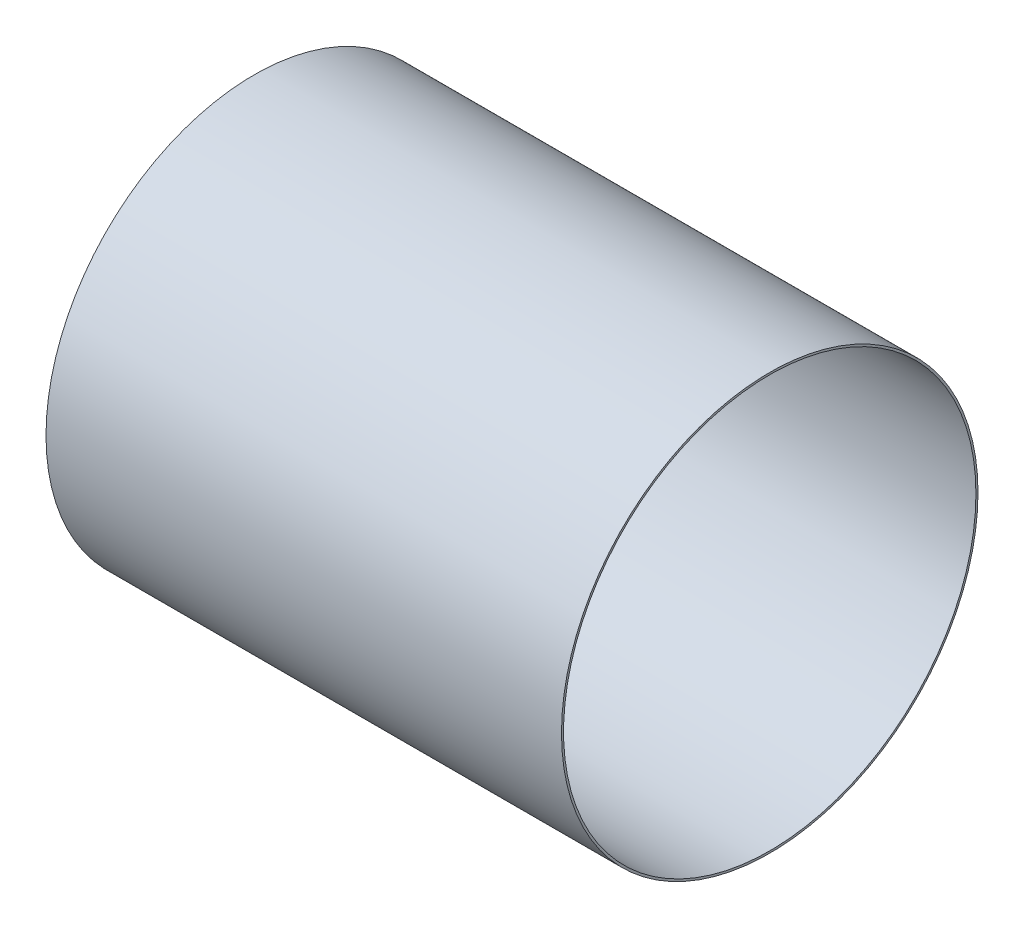
ISO-10303-21;
HEADER;
FILE_DESCRIPTION(('STEP AP214'),'2;1');
FILE_NAME('part.step','',(''),(''),'','','');
FILE_SCHEMA(('AUTOMOTIVE_DESIGN { 1 0 10303 214 1 1 1 1 }'));
ENDSEC;
DATA;
#1=APPLICATION_CONTEXT('core data for automotive mechanical design processes');
#2=APPLICATION_PROTOCOL_DEFINITION('international standard','automotive_design',2000,#1);
#3=PRODUCT_CONTEXT('',#1,'mechanical');
#4=PRODUCT('Part','Part','',(#3));
#5=PRODUCT_RELATED_PRODUCT_CATEGORY('part','',(#4));
#6=PRODUCT_DEFINITION_FORMATION('','',#4);
#7=PRODUCT_DEFINITION_CONTEXT('part definition',#1,'design');
#8=PRODUCT_DEFINITION('design','',#6,#7);
#9=PRODUCT_DEFINITION_SHAPE('','',#8);
#10=(LENGTH_UNIT() NAMED_UNIT(*) SI_UNIT(.MILLI.,.METRE.));
#11=(NAMED_UNIT(*) PLANE_ANGLE_UNIT() SI_UNIT($,.RADIAN.));
#12=(NAMED_UNIT(*) SI_UNIT($,.STERADIAN.) SOLID_ANGLE_UNIT());
#13=UNCERTAINTY_MEASURE_WITH_UNIT(LENGTH_MEASURE(1.E-05),#10,'distance_accuracy_value','');
#14=(GEOMETRIC_REPRESENTATION_CONTEXT(3) GLOBAL_UNCERTAINTY_ASSIGNED_CONTEXT((#13)) GLOBAL_UNIT_ASSIGNED_CONTEXT((#10,
#11,#12)) REPRESENTATION_CONTEXT('',''));
#15=CARTESIAN_POINT('',(0.,0.,0.));
#16=DIRECTION('',(0.,0.,1.));
#17=DIRECTION('',(1.,0.,0.));
#18=AXIS2_PLACEMENT_3D('',#15,#16,#17);
#19=CARTESIAN_POINT('',(0.,0.,0.));
#20=DIRECTION('',(-1.,0.,0.));
#21=DIRECTION('',(0.,0.,1.));
#22=AXIS2_PLACEMENT_3D('',#19,#20,#21);
#23=PLANE('',#22);
#24=CARTESIAN_POINT('',(0.,101.,0.));
#25=DIRECTION('',(1.,0.,0.));
#26=DIRECTION('',(0.,0.,-1.));
#27=AXIS2_PLACEMENT_3D('',#24,#25,#26);
#28=CIRCLE('',#27,100.);
#29=CARTESIAN_POINT('',(0.,101.,-100.));
#30=VERTEX_POINT('',#29);
#31=EDGE_CURVE('E49',#30,#30,#28,.T.);
#32=ORIENTED_EDGE('',*,*,#31,.T.);
#33=EDGE_LOOP('',(#32));
#34=FACE_BOUND('',#33,.T.);
#35=CARTESIAN_POINT('',(0.,101.,0.));
#36=DIRECTION('',(-1.,0.,0.));
#37=DIRECTION('',(0.,0.,1.));
#38=AXIS2_PLACEMENT_3D('',#35,#36,#37);
#39=CIRCLE('',#38,101.);
#40=CARTESIAN_POINT('',(0.,101.,101.));
#41=VERTEX_POINT('',#40);
#42=EDGE_CURVE('E45',#41,#41,#39,.T.);
#43=ORIENTED_EDGE('',*,*,#42,.T.);
#44=EDGE_LOOP('',(#43));
#45=FACE_BOUND('',#44,.T.);
#46=ADVANCED_FACE('F39',(#34,#45),#23,.T.);
#47=CARTESIAN_POINT('',(250.,0.,0.));
#48=DIRECTION('',(1.,0.,0.));
#49=DIRECTION('',(0.,0.,-1.));
#50=AXIS2_PLACEMENT_3D('',#47,#48,#49);
#51=PLANE('',#50);
#52=CARTESIAN_POINT('',(250.,101.,0.));
#53=DIRECTION('',(1.,0.,0.));
#54=DIRECTION('',(0.,0.,-1.));
#55=AXIS2_PLACEMENT_3D('',#52,#53,#54);
#56=CIRCLE('',#55,100.);
#57=CARTESIAN_POINT('',(250.,101.,-100.));
#58=VERTEX_POINT('',#57);
#59=EDGE_CURVE('E53',#58,#58,#56,.T.);
#60=ORIENTED_EDGE('',*,*,#59,.F.);
#61=EDGE_LOOP('',(#60));
#62=FACE_BOUND('',#61,.T.);
#63=CARTESIAN_POINT('',(250.,101.,0.));
#64=DIRECTION('',(-1.,0.,0.));
#65=DIRECTION('',(0.,0.,1.));
#66=AXIS2_PLACEMENT_3D('',#63,#64,#65);
#67=CIRCLE('',#66,101.);
#68=CARTESIAN_POINT('',(250.,101.,101.));
#69=VERTEX_POINT('',#68);
#70=EDGE_CURVE('E10',#69,#69,#67,.T.);
#71=ORIENTED_EDGE('',*,*,#70,.F.);
#72=EDGE_LOOP('',(#71));
#73=FACE_BOUND('',#72,.T.);
#74=ADVANCED_FACE('F61',(#62,#73),#51,.T.);
#75=CARTESIAN_POINT('',(0.,101.,0.));
#76=DIRECTION('',(-1.,0.,0.));
#77=DIRECTION('',(0.,0.,1.));
#78=AXIS2_PLACEMENT_3D('',#75,#76,#77);
#79=CYLINDRICAL_SURFACE('',#78,101.);
#80=ORIENTED_EDGE('',*,*,#70,.T.);
#81=EDGE_LOOP('',(#80));
#82=FACE_BOUND('',#81,.T.);
#83=ORIENTED_EDGE('',*,*,#42,.F.);
#84=EDGE_LOOP('',(#83));
#85=FACE_BOUND('',#84,.T.);
#86=ADVANCED_FACE('F64',(#82,#85),#79,.T.);
#87=CARTESIAN_POINT('',(0.,101.,0.));
#88=DIRECTION('',(1.,0.,0.));
#89=DIRECTION('',(0.,0.,-1.));
#90=AXIS2_PLACEMENT_3D('',#87,#88,#89);
#91=CYLINDRICAL_SURFACE('',#90,100.);
#92=ORIENTED_EDGE('',*,*,#31,.F.);
#93=EDGE_LOOP('',(#92));
#94=FACE_BOUND('',#93,.T.);
#95=ORIENTED_EDGE('',*,*,#59,.T.);
#96=EDGE_LOOP('',(#95));
#97=FACE_BOUND('',#96,.T.);
#98=ADVANCED_FACE('F59',(#94,#97),#91,.F.);
#99=CLOSED_SHELL('',(#46,#74,#86,#98));
#100=MANIFOLD_SOLID_BREP('B2',#99);
#101=ADVANCED_BREP_SHAPE_REPRESENTATION('',(#18,#100),#14);
#102=SHAPE_DEFINITION_REPRESENTATION(#9,#101);
ENDSEC;
END-ISO-10303-21;
